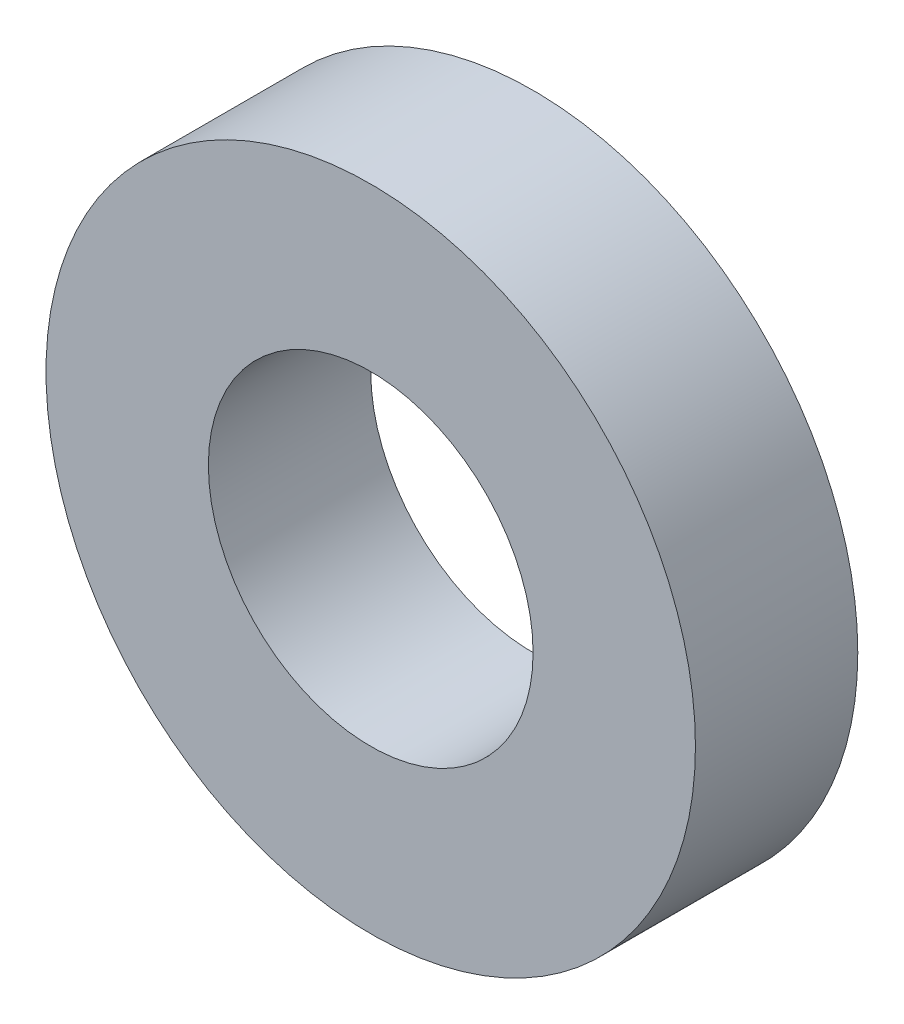
ISO-10303-21;
HEADER;
FILE_DESCRIPTION(('STEP AP214'),'2;1');
FILE_NAME('part.step','',(''),(''),'','','');
FILE_SCHEMA(('AUTOMOTIVE_DESIGN { 1 0 10303 214 1 1 1 1 }'));
ENDSEC;
DATA;
#1=APPLICATION_CONTEXT('core data for automotive mechanical design processes');
#2=APPLICATION_PROTOCOL_DEFINITION('international standard','automotive_design',2000,#1);
#3=PRODUCT_CONTEXT('',#1,'mechanical');
#4=PRODUCT('Part','Part','',(#3));
#5=PRODUCT_RELATED_PRODUCT_CATEGORY('part','',(#4));
#6=PRODUCT_DEFINITION_FORMATION('','',#4);
#7=PRODUCT_DEFINITION_CONTEXT('part definition',#1,'design');
#8=PRODUCT_DEFINITION('design','',#6,#7);
#9=PRODUCT_DEFINITION_SHAPE('','',#8);
#10=(LENGTH_UNIT() NAMED_UNIT(*) SI_UNIT(.MILLI.,.METRE.));
#11=(NAMED_UNIT(*) PLANE_ANGLE_UNIT() SI_UNIT($,.RADIAN.));
#12=(NAMED_UNIT(*) SI_UNIT($,.STERADIAN.) SOLID_ANGLE_UNIT());
#13=UNCERTAINTY_MEASURE_WITH_UNIT(LENGTH_MEASURE(1.E-05),#10,'distance_accuracy_value','');
#14=(GEOMETRIC_REPRESENTATION_CONTEXT(3) GLOBAL_UNCERTAINTY_ASSIGNED_CONTEXT((#13)) GLOBAL_UNIT_ASSIGNED_CONTEXT((#10,
#11,#12)) REPRESENTATION_CONTEXT('',''));
#15=CARTESIAN_POINT('',(0.,0.,0.));
#16=DIRECTION('',(0.,0.,1.));
#17=DIRECTION('',(1.,0.,0.));
#18=AXIS2_PLACEMENT_3D('',#15,#16,#17);
#19=CARTESIAN_POINT('',(0.,0.,1.));
#20=DIRECTION('',(0.,0.,1.));
#21=DIRECTION('',(1.,0.,0.));
#22=AXIS2_PLACEMENT_3D('',#19,#20,#21);
#23=PLANE('',#22);
#24=CARTESIAN_POINT('',(0.,0.,1.));
#25=DIRECTION('',(0.,0.,1.));
#26=DIRECTION('',(1.,0.,0.));
#27=AXIS2_PLACEMENT_3D('',#24,#25,#26);
#28=CIRCLE('',#27,2.);
#29=CARTESIAN_POINT('',(2.,0.,1.));
#30=VERTEX_POINT('',#29);
#31=EDGE_CURVE('E10',#30,#30,#28,.T.);
#32=ORIENTED_EDGE('',*,*,#31,.T.);
#33=EDGE_LOOP('',(#32));
#34=FACE_BOUND('',#33,.T.);
#35=CARTESIAN_POINT('',(0.,0.,1.));
#36=DIRECTION('',(0.,0.,1.));
#37=DIRECTION('',(1.,0.,0.));
#38=AXIS2_PLACEMENT_3D('',#35,#36,#37);
#39=CIRCLE('',#38,1.);
#40=CARTESIAN_POINT('',(1.,0.,1.));
#41=VERTEX_POINT('',#40);
#42=EDGE_CURVE('E50',#41,#41,#39,.T.);
#43=ORIENTED_EDGE('',*,*,#42,.F.);
#44=EDGE_LOOP('',(#43));
#45=FACE_BOUND('',#44,.T.);
#46=ADVANCED_FACE('F37',(#34,#45),#23,.T.);
#47=CARTESIAN_POINT('',(0.,0.,0.));
#48=DIRECTION('',(0.,0.,1.));
#49=DIRECTION('',(1.,0.,0.));
#50=AXIS2_PLACEMENT_3D('',#47,#48,#49);
#51=PLANE('',#50);
#52=CARTESIAN_POINT('',(0.,0.,0.));
#53=DIRECTION('',(0.,0.,1.));
#54=DIRECTION('',(1.,0.,0.));
#55=AXIS2_PLACEMENT_3D('',#52,#53,#54);
#56=CIRCLE('',#55,2.);
#57=CARTESIAN_POINT('',(2.,0.,0.));
#58=VERTEX_POINT('',#57);
#59=EDGE_CURVE('E41',#58,#58,#56,.T.);
#60=ORIENTED_EDGE('',*,*,#59,.F.);
#61=EDGE_LOOP('',(#60));
#62=FACE_BOUND('',#61,.T.);
#63=CARTESIAN_POINT('',(0.,0.,0.));
#64=DIRECTION('',(0.,0.,1.));
#65=DIRECTION('',(1.,0.,0.));
#66=AXIS2_PLACEMENT_3D('',#63,#64,#65);
#67=CIRCLE('',#66,1.);
#68=CARTESIAN_POINT('',(1.,0.,0.));
#69=VERTEX_POINT('',#68);
#70=EDGE_CURVE('E52',#69,#69,#67,.T.);
#71=ORIENTED_EDGE('',*,*,#70,.T.);
#72=EDGE_LOOP('',(#71));
#73=FACE_BOUND('',#72,.T.);
#74=ADVANCED_FACE('F64',(#62,#73),#51,.F.);
#75=CARTESIAN_POINT('',(0.,0.,1.));
#76=DIRECTION('',(0.,0.,-1.));
#77=DIRECTION('',(-1.,0.,0.));
#78=AXIS2_PLACEMENT_3D('',#75,#76,#77);
#79=CYLINDRICAL_SURFACE('',#78,2.);
#80=ORIENTED_EDGE('',*,*,#31,.F.);
#81=EDGE_LOOP('',(#80));
#82=FACE_BOUND('',#81,.T.);
#83=ORIENTED_EDGE('',*,*,#59,.T.);
#84=EDGE_LOOP('',(#83));
#85=FACE_BOUND('',#84,.T.);
#86=ADVANCED_FACE('F39',(#82,#85),#79,.T.);
#87=CARTESIAN_POINT('',(0.,0.,1.));
#88=DIRECTION('',(0.,0.,-1.));
#89=DIRECTION('',(-1.,0.,0.));
#90=AXIS2_PLACEMENT_3D('',#87,#88,#89);
#91=CYLINDRICAL_SURFACE('',#90,1.);
#92=ORIENTED_EDGE('',*,*,#42,.T.);
#93=EDGE_LOOP('',(#92));
#94=FACE_BOUND('',#93,.T.);
#95=ORIENTED_EDGE('',*,*,#70,.F.);
#96=EDGE_LOOP('',(#95));
#97=FACE_BOUND('',#96,.T.);
#98=ADVANCED_FACE('F60',(#94,#97),#91,.F.);
#99=CLOSED_SHELL('',(#46,#74,#86,#98));
#100=MANIFOLD_SOLID_BREP('B2',#99);
#101=ADVANCED_BREP_SHAPE_REPRESENTATION('',(#18,#100),#14);
#102=SHAPE_DEFINITION_REPRESENTATION(#9,#101);
ENDSEC;
END-ISO-10303-21;
